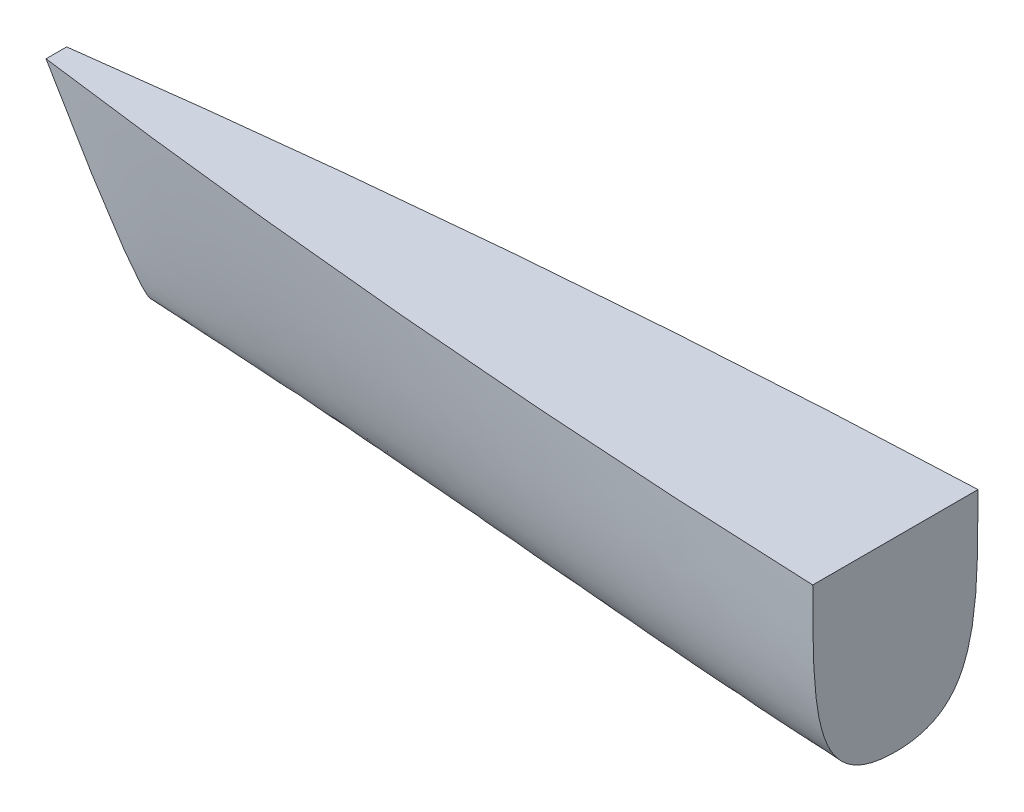
ISO-10303-21;
HEADER;
FILE_DESCRIPTION(('STEP AP214'),'2;1');
FILE_NAME('part.step','',(''),(''),'','','');
FILE_SCHEMA(('AUTOMOTIVE_DESIGN { 1 0 10303 214 1 1 1 1 }'));
ENDSEC;
DATA;
#1=APPLICATION_CONTEXT('core data for automotive mechanical design processes');
#2=APPLICATION_PROTOCOL_DEFINITION('international standard','automotive_design',2000,#1);
#3=PRODUCT_CONTEXT('',#1,'mechanical');
#4=PRODUCT('Part','Part','',(#3));
#5=PRODUCT_RELATED_PRODUCT_CATEGORY('part','',(#4));
#6=PRODUCT_DEFINITION_FORMATION('','',#4);
#7=PRODUCT_DEFINITION_CONTEXT('part definition',#1,'design');
#8=PRODUCT_DEFINITION('design','',#6,#7);
#9=PRODUCT_DEFINITION_SHAPE('','',#8);
#10=(LENGTH_UNIT() NAMED_UNIT(*) SI_UNIT(.MILLI.,.METRE.));
#11=(NAMED_UNIT(*) PLANE_ANGLE_UNIT() SI_UNIT($,.RADIAN.));
#12=(NAMED_UNIT(*) SI_UNIT($,.STERADIAN.) SOLID_ANGLE_UNIT());
#13=UNCERTAINTY_MEASURE_WITH_UNIT(LENGTH_MEASURE(1.E-05),#10,'distance_accuracy_value','');
#14=(GEOMETRIC_REPRESENTATION_CONTEXT(3) GLOBAL_UNCERTAINTY_ASSIGNED_CONTEXT((#13)) GLOBAL_UNIT_ASSIGNED_CONTEXT((#10,
#11,#12)) REPRESENTATION_CONTEXT('',''));
#15=CARTESIAN_POINT('',(0.,0.,0.));
#16=DIRECTION('',(0.,0.,1.));
#17=DIRECTION('',(1.,0.,0.));
#18=AXIS2_PLACEMENT_3D('',#15,#16,#17);
#19=CARTESIAN_POINT('',(0.,0.,0.));
#20=DIRECTION('',(1.,0.,0.));
#21=DIRECTION('',(0.,0.,-1.));
#22=AXIS2_PLACEMENT_3D('',#19,#20,#21);
#23=PLANE('',#22);
#24=DIRECTION('',(0.,0.,-1.));
#25=VECTOR('',#24,1.);
#26=CARTESIAN_POINT('',(0.,101.6,44.45));
#27=LINE('',#26,#25);
#28=CARTESIAN_POINT('',(9.40191802610385E-11,101.6,50.8000000000035));
#29=VERTEX_POINT('',#28);
#30=CARTESIAN_POINT('',(9.40191802610385E-11,101.6,-50.8000000000035));
#31=VERTEX_POINT('',#30);
#32=EDGE_CURVE('E79',#29,#31,#27,.T.);
#33=ORIENTED_EDGE('',*,*,#32,.F.);
#34=CARTESIAN_POINT('',(-4.47736069341578E-09,-12.7000000000048,0.));
#35=CARTESIAN_POINT('',(-4.45366732851943E-09,-12.6999707094019,0.781487751641772));
#36=CARTESIAN_POINT('',(-4.42971820009839E-09,-12.6889781682521,1.5630419349123));
#37=CARTESIAN_POINT('',(-4.38192011345438E-09,-12.6437010870272,3.10169913771779));
#38=CARTESIAN_POINT('',(-4.3580902153228E-09,-12.6101342953921,3.85882366023383));
#39=CARTESIAN_POINT('',(-4.31043945637957E-09,-12.5199320026486,5.34902751975938));
#40=CARTESIAN_POINT('',(-4.28663958618666E-09,-12.4640154972523,6.08214958026038));
#41=CARTESIAN_POINT('',(-4.23918911087635E-09,-12.3292978902542,7.52470274285807));
#42=CARTESIAN_POINT('',(-4.21555446043169E-09,-12.2512131273073,8.2342002157884));
#43=CARTESIAN_POINT('',(-4.16826270267955E-09,-12.0723599111245,9.62987044012015));
#44=CARTESIAN_POINT('',(-4.14462530548699E-09,-11.9722988449897,10.3161332422138));
#45=CARTESIAN_POINT('',(-4.09752950081662E-09,-11.7496973949316,11.6656967473971));
#46=CARTESIAN_POINT('',(-4.07408396605494E-09,-11.6278488428377,12.3291109860748));
#47=CARTESIAN_POINT('',(-4.02712035639675E-09,-11.3618845844641,13.6333412633285));
#48=CARTESIAN_POINT('',(-4.00362036377617E-09,-11.218437850424,14.2742931580272));
#49=CARTESIAN_POINT('',(-3.95680463212218E-09,-10.9094968294993,15.5339637655974));
#50=CARTESIAN_POINT('',(-3.93349889224186E-09,-10.744640963376,16.1528385225982));
#51=CARTESIAN_POINT('',(-3.88686751606332E-09,-10.3931093121053,17.3687223145348));
#52=CARTESIAN_POINT('',(-3.8635550752632E-09,-10.2070335469576,17.9659043364015));
#53=CARTESIAN_POINT('',(-3.81699681902432E-09,-9.81329776601531,19.1387736399576));
#54=CARTESIAN_POINT('',(-3.79376047029151E-09,-9.60619170353381,19.7146464528796));
#55=CARTESIAN_POINT('',(-3.74734862029848E-09,-9.170638743577,20.8452730457951));
#56=CARTESIAN_POINT('',(-3.72418093818784E-09,-8.94269263807592,21.400219380165));
#57=CARTESIAN_POINT('',(-3.67784564586512E-09,-8.46571002893252,22.4893745727515));
#58=CARTESIAN_POINT('',(-3.65468520317717E-09,-8.21711505234996,23.0237764990578));
#59=CARTESIAN_POINT('',(-3.60848595195766E-09,-7.69909099889839,24.0722312469046));
#60=CARTESIAN_POINT('',(-3.5854507165306E-09,-7.43003948152166,24.5864703962378));
#61=CARTESIAN_POINT('',(-3.53937030355996E-09,-6.87136292875235,25.5949954602892));
#62=CARTESIAN_POINT('',(-3.51632909795275E-09,-6.58204853747093,26.0894533119272));
#63=CARTESIAN_POINT('',(-3.4703152038318E-09,-5.98310918714257,27.0588194509133));
#64=CARTESIAN_POINT('',(-3.44734429899788E-09,-5.67372701426701,27.5338776660173));
#65=CARTESIAN_POINT('',(-3.40141615486548E-09,-5.0349152857695,28.4648558464261));
#66=CARTESIAN_POINT('',(-3.37846021910957E-09,-4.70566182886777,28.9208966140225));
#67=CARTESIAN_POINT('',(-3.33260349131233E-09,-4.02736876232375,29.8142582167664));
#68=CARTESIAN_POINT('',(-3.30970303997775E-09,-3.6784417905124,30.2516645733004));
#69=CARTESIAN_POINT('',(-3.26392667012989E-09,-2.96105889858107,31.1081815755418));
#70=CARTESIAN_POINT('',(-3.24105084758921E-09,-2.59265721718293,31.5273376606002));
#71=CARTESIAN_POINT('',(-3.19532383563999E-09,-1.83657629941983,32.347782773729));
#72=CARTESIAN_POINT('',(-3.1724726435475E-09,-1.44889943992592,32.7490739932511));
#73=CARTESIAN_POINT('',(-3.12679273175931E-09,-0.654512378917812,33.5342207439993));
#74=CARTESIAN_POINT('',(-3.10396418611828E-09,-0.247760251175753,33.9180338262512));
#75=CARTESIAN_POINT('',(-3.05837700848049E-09,0.584541188637023,34.6686565761279));
#76=CARTESIAN_POINT('',(-3.03561918638764E-09,1.01016864260761,35.0353795219674));
#77=CARTESIAN_POINT('',(-2.99002738659927E-09,1.87999299346549,35.7522534280396));
#78=CARTESIAN_POINT('',(-2.96719393657309E-09,2.32429610799612,36.1022753707059));
#79=CARTESIAN_POINT('',(-2.9216009365089E-09,3.23125234239316,36.786176299614));
#80=CARTESIAN_POINT('',(-2.89884377989147E-09,3.69403197678958,37.1198873018264));
#81=CARTESIAN_POINT('',(-2.85332036073557E-09,4.63772959919391,37.7715917059864));
#82=CARTESIAN_POINT('',(-2.83055652736659E-09,5.11878730134776,38.0893825161859));
#83=CARTESIAN_POINT('',(-2.78504286890497E-09,6.09883641928646,38.7096673099536));
#84=CARTESIAN_POINT('',(-2.76229655939743E-09,6.59797454833304,39.0119291360415));
#85=CARTESIAN_POINT('',(-2.71681655609945E-09,7.61398580238174,39.6015715043192));
#86=CARTESIAN_POINT('',(-2.69408718760793E-09,8.13100744610802,39.8886957138591));
#87=CARTESIAN_POINT('',(-2.64857754172488E-09,9.18259227931243,40.4484731777496));
#88=CARTESIAN_POINT('',(-2.62580143538289E-09,9.71730163586938,40.7208513741957));
#89=CARTESIAN_POINT('',(-2.58030868260116E-09,10.8040711118557,41.251540930432));
#90=CARTESIAN_POINT('',(-2.55759860238851E-09,11.3562718509201,41.5095637587779));
#91=CARTESIAN_POINT('',(-2.51207750930681E-09,12.4778408976706,42.0119446409976));
#92=CARTESIAN_POINT('',(-2.48927105294809E-09,13.047342068145,42.2560056446732));
#93=CARTESIAN_POINT('',(-2.44375872687278E-09,14.203312921084,42.73084834855));
#94=CARTESIAN_POINT('',(-2.42106136439048E-09,14.7899058910274,42.9613287054393));
#95=CARTESIAN_POINT('',(-2.35221451287566E-09,16.5909650041421,43.6395235377354));
#96=CARTESIAN_POINT('',(-2.30655657830168E-09,17.8156729065473,44.0602109546952));
#97=CARTESIAN_POINT('',(-2.21526940078216E-09,20.3301926861742,44.8542729737344));
#98=CARTESIAN_POINT('',(-2.16970426593822E-09,21.620732712122,45.2253086462873));
#99=CARTESIAN_POINT('',(-2.07833635816551E-09,24.2656666833734,45.9231115357718));
#100=CARTESIAN_POINT('',(-2.03258926863268E-09,25.6206349326412,46.2476851700081));
#101=CARTESIAN_POINT('',(-1.94091122802775E-09,28.3930082657146,46.8554982033305));
#102=CARTESIAN_POINT('',(-1.89503776327385E-09,29.8108487118198,47.1367301403007));
#103=CARTESIAN_POINT('',(-1.8031068105125E-09,32.707567119788,47.6607732784165));
#104=CARTESIAN_POINT('',(-1.75710495937111E-09,34.186767289243,47.9017844629283));
#105=CARTESIAN_POINT('',(-1.66493108656309E-09,37.2047678238614,48.3482816640007));
#106=CARTESIAN_POINT('',(-1.61881232092425E-09,38.7438002745625,48.5521804027371));
#107=CARTESIAN_POINT('',(-1.52627915434583E-09,41.8800068374668,48.9273432886412));
#108=CARTESIAN_POINT('',(-1.47991011428412E-09,43.4773438521192,49.0972280818237));
#109=CARTESIAN_POINT('',(-1.38694311716917E-09,46.7286805702724,49.4072770566732));
#110=CARTESIAN_POINT('',(-1.34038920936828E-09,48.3827914468087,49.5462595166903));
#111=CARTESIAN_POINT('',(-1.24701070833235E-09,51.7461740770097,49.7973630062423));
#112=CARTESIAN_POINT('',(-1.20022501944852E-09,53.4555191318386,49.9084835375982));
#113=CARTESIAN_POINT('',(-1.05735405333697E-09,58.7411843474163,50.2106641212133));
#114=CARTESIAN_POINT('',(-9.63162646276416E-10,62.3200696784898,50.3566993833725));
#115=CARTESIAN_POINT('',(-8.22758162324925E-10,67.7654104503835,50.5216473998408));
#116=CARTESIAN_POINT('',(-7.7516905878392E-10,69.6312114045692,50.5679471037314));
#117=CARTESIAN_POINT('',(-6.7969903275123E-10,73.4119103561285,50.6454793729367));
#118=CARTESIAN_POINT('',(-6.3184296751189E-10,75.3268175596709,50.6762867032826));
#119=CARTESIAN_POINT('',(-5.35763610913864E-10,79.2041484885118,50.7258817368804));
#120=CARTESIAN_POINT('',(-4.87560521046109E-10,81.1665758257082,50.7443532487314));
#121=CARTESIAN_POINT('',(-3.90864017270271E-10,85.137414800624,50.7722535915417));
#122=CARTESIAN_POINT('',(-3.42390204111398E-10,87.1458279184803,50.7814607082577));
#123=CARTESIAN_POINT('',(-2.45047892762379E-10,91.2070889082284,50.793870336641));
#124=CARTESIAN_POINT('',(-1.96194377295594E-10,93.2599370936573,50.7969355390775));
#125=CARTESIAN_POINT('',(-9.81199514417062E-11,97.4085249587485,50.7999955091068));
#126=CARTESIAN_POINT('',(-4.89126889609797E-11,99.5042647053791,50.7999247910011));
#127=CARTESIAN_POINT('',(0.,101.6,50.8));
#128=B_SPLINE_CURVE_WITH_KNOTS('',3,(#34,#35,#36,#37,#38,#39,#40,#41,#42,#43,#44,#45,#46,#47,
#48,#49,#50,#51,#52,#53,#54,#55,#56,#57,#58,#59,#60,#61,#62,#63,#64,#65,#66,#67,#68,#69,#70,#71,
#72,#73,#74,#75,#76,#77,#78,#79,#80,#81,#82,#83,#84,#85,#86,#87,#88,#89,#90,#91,#92,#93,#94,#95,
#96,#97,#98,#99,#100,#101,#102,#103,#104,#105,#106,#107,#108,#109,#110,#111,#112,#113,#114,#115,
#116,#117,#118,#119,#120,#121,#122,#123,#124,#125,#126,#127),.UNSPECIFIED.,.F.,.F.,(4,2,2,2,2,2,
2,2,2,2,2,2,2,2,2,2,2,2,2,2,2,2,2,2,2,2,2,2,2,2,2,2,2,2,2,2,2,2,2,2,2,2,2,2,2,2,4),(0.,
2.34448344306046,4.61774226111642,6.82310024341743,8.96402535855335,11.0441331812292,
13.0671882793458,15.0371030237134,16.9579332678533,18.8338703702723,20.6692291084447,
22.4684311716548,24.2359841218744,25.976455971705,27.6944458284447,29.3945513644529,
31.0813341586681,32.7592841724686,34.4327847407006,36.1060794546907,37.7832421862112,
39.4681512670997,41.164468531767,42.87562359078,44.6048033744678,46.3549466998827,
48.1287433942653,49.9286373621692,51.7568329090987,53.61530362153,55.5058031370405,
59.3885196148072,63.4155115389168,67.5941712327691,71.9295940697895,76.4249473575493,
81.0817950020447,85.9003767053856,90.8798446583309,96.0184625913589,106.762495300085,
112.361605648281,118.106994580152,123.994511562909,130.019797185493,136.178345565122,
142.465558891021),.UNSPECIFIED.);
#129=CARTESIAN_POINT('',(0.,-12.6999999999999,0.));
#130=VERTEX_POINT('',#129);
#131=EDGE_CURVE('E81',#130,#29,#128,.T.);
#132=ORIENTED_EDGE('',*,*,#131,.F.);
#133=CARTESIAN_POINT('',(9.40219175513375E-11,101.6,-50.8000000000035));
#134=CARTESIAN_POINT('',(9.03848008340078E-11,33.8666666666628,-50.800000000004));
#135=CARTESIAN_POINT('',(8.79168231380156E-11,-12.6999999999998,-50.8000000000073));
#136=CARTESIAN_POINT('',(8.88058790979759E-11,-12.6999999999998,0.));
#137=B_SPLINE_CURVE_WITH_KNOTS('',3,(#133,#134,#135,#136),.UNSPECIFIED.,.F.,.F.,(4,4),(0.,1.),.UNSPECIFIED.);
#138=EDGE_CURVE('E82',#31,#130,#137,.T.);
#139=ORIENTED_EDGE('',*,*,#138,.F.);
#140=EDGE_LOOP('',(#33,#132,#139));
#141=FACE_BOUND('',#140,.T.);
#142=ADVANCED_FACE('F35',(#141),#23,.T.);
#143=CARTESIAN_POINT('',(-473.829393674833,28.8029547438754,4.7625));
#144=DIRECTION('',(-0.866025403784437,-0.500000000000003,0.));
#145=DIRECTION('',(0.500000000000003,-0.866025403784437,0.));
#146=AXIS2_PLACEMENT_3D('',#143,#144,#145);
#147=PLANE('',#146);
#148=CARTESIAN_POINT('',(-515.858787349667,101.6,6.35));
#149=CARTESIAN_POINT('',(-481.992120683,42.9412126503344,6.35));
#150=CARTESIAN_POINT('',(-457.2,0.,4.23333333333333));
#151=CARTESIAN_POINT('',(-457.2,0.,0.));
#152=B_SPLINE_CURVE_WITH_KNOTS('',3,(#148,#149,#150,#151),.UNSPECIFIED.,.F.,.F.,(4,4),(0.,1.),.UNSPECIFIED.);
#153=CARTESIAN_POINT('',(-515.858787349667,101.6,6.35));
#154=VERTEX_POINT('',#153);
#155=CARTESIAN_POINT('',(-457.2,0.,0.));
#156=VERTEX_POINT('',#155);
#157=EDGE_CURVE('E97',#154,#156,#152,.T.);
#158=ORIENTED_EDGE('',*,*,#157,.F.);
#159=DIRECTION('',(0.,0.,1.));
#160=VECTOR('',#159,1.);
#161=CARTESIAN_POINT('',(-515.858787349667,101.6,6.35));
#162=LINE('',#161,#160);
#163=CARTESIAN_POINT('',(-515.858787349667,101.6,0.));
#164=VERTEX_POINT('',#163);
#165=EDGE_CURVE('E93',#164,#154,#162,.T.);
#166=ORIENTED_EDGE('',*,*,#165,.F.);
#167=DIRECTION('',(0.,0.,-1.));
#168=VECTOR('',#167,1.);
#169=CARTESIAN_POINT('',(-515.858787349667,101.6,-6.35));
#170=LINE('',#169,#168);
#171=CARTESIAN_POINT('',(-515.858787349667,101.6,-6.35));
#172=VERTEX_POINT('',#171);
#173=EDGE_CURVE('E48',#164,#172,#170,.T.);
#174=ORIENTED_EDGE('',*,*,#173,.T.);
#175=CARTESIAN_POINT('',(-515.858787349667,101.6,-6.35));
#176=CARTESIAN_POINT('',(-481.992120683,42.9412126503344,-6.35));
#177=CARTESIAN_POINT('',(-457.2,0.,-4.23333333333333));
#178=CARTESIAN_POINT('',(-457.2,0.,0.));
#179=B_SPLINE_CURVE_WITH_KNOTS('',3,(#175,#176,#177,#178),.UNSPECIFIED.,.F.,.F.,(4,4),(0.,1.),.UNSPECIFIED.);
#180=EDGE_CURVE('E11',#172,#156,#179,.T.);
#181=ORIENTED_EDGE('',*,*,#180,.T.);
#182=EDGE_LOOP('',(#158,#166,#174,#181));
#183=FACE_BOUND('',#182,.T.);
#184=ADVANCED_FACE('F169',(#183),#147,.T.);
#185=CARTESIAN_POINT('',(457.2,0.,0.));
#186=CARTESIAN_POINT('',(304.8,-8.4666666666666,0.));
#187=CARTESIAN_POINT('',(-24.1558528702352,-16.9466068796095,0.));
#188=CARTESIAN_POINT('',(-304.8,-8.4666666666666,0.));
#189=CARTESIAN_POINT('',(-457.2,0.,0.));
#190=CARTESIAN_POINT('',(457.2,0.,59.2666666666667));
#191=CARTESIAN_POINT('',(304.694653848716,-5.6444444444444,62.6627208631764));
#192=CARTESIAN_POINT('',(-27.0609494606047,-19.7776781326826,62.3667373112781));
#193=CARTESIAN_POINT('',(-298.387703112432,-5.6444444444444,11.8627208631764));
#194=CARTESIAN_POINT('',(-457.2,0.,4.23333333333333));
#195=CARTESIAN_POINT('',(457.2,16.9333333333334,44.45));
#196=CARTESIAN_POINT('',(304.589307697432,14.1111111111112,51.2421083930194));
#197=CARTESIAN_POINT('',(-18.5135242684559,41.6700336822248,64.0453866142405));
#198=CARTESIAN_POINT('',(-316.767526907864,40.1189904281121,21.6087750596861));
#199=CARTESIAN_POINT('',(-481.992120683,42.9412126503344,6.35));
#200=CARTESIAN_POINT('',(457.2,101.6,44.45));
#201=CARTESIAN_POINT('',(304.483961546148,101.6,54.6381625895292));
#202=CARTESIAN_POINT('',(-5.77418516651111,101.6,58.6831296847267));
#203=CARTESIAN_POINT('',(-344.221896686963,101.6,29.2381625895292));
#204=CARTESIAN_POINT('',(-515.858787349667,101.6,6.35));
#205=B_SPLINE_SURFACE_WITH_KNOTS('',3,3,((#185,#186,#187,#188,#189),(#190,#191,#192,#193,#194),
(#195,#196,#197,#198,#199),(#200,#201,#202,#203,#204)),.UNSPECIFIED.,.F.,.F.,.F.,(4,4),(4,1,4),
(0.,1.),(0.,0.48021814139568,1.),.UNSPECIFIED.);
#206=CARTESIAN_POINT('',(457.2,0.,0.));
#207=CARTESIAN_POINT('',(304.8,-8.46666666666659,0.));
#208=CARTESIAN_POINT('',(-24.1558528702352,-16.9466068796095,0.));
#209=CARTESIAN_POINT('',(-304.8,-8.46666666666659,0.));
#210=CARTESIAN_POINT('',(-457.2,0.,0.));
#211=B_SPLINE_CURVE_WITH_KNOTS('',3,(#206,#207,#208,#209,#210),.UNSPECIFIED.,.F.,.F.,(4,1,4),
(0.,0.48021814139568,1.),.UNSPECIFIED.);
#212=EDGE_CURVE('E64',#130,#156,#211,.T.);
#213=CARTESIAN_POINT('',(457.2,101.6,44.45));
#214=CARTESIAN_POINT('',(304.483961546148,101.6,54.6381625895292));
#215=CARTESIAN_POINT('',(-5.77418516651111,101.6,58.6831296847267));
#216=CARTESIAN_POINT('',(-344.221896686963,101.6,29.2381625895292));
#217=CARTESIAN_POINT('',(-515.858787349667,101.6,6.35));
#218=B_SPLINE_CURVE_WITH_KNOTS('',3,(#213,#214,#215,#216,#217),.UNSPECIFIED.,.F.,.F.,(4,1,4),
(0.,0.48021814139568,1.),.UNSPECIFIED.);
#219=EDGE_CURVE('E88',#154,#29,#218,.F.);
#220=ORIENTED_EDGE('',*,*,#212,.F.);
#221=ORIENTED_EDGE('',*,*,#131,.T.);
#222=ORIENTED_EDGE('',*,*,#219,.F.);
#223=ORIENTED_EDGE('',*,*,#157,.T.);
#224=EDGE_LOOP('',(#220,#221,#222,#223));
#225=FACE_BOUND('',#224,.T.);
#226=ADVANCED_FACE('F86',(#225),#205,.T.);
#227=CARTESIAN_POINT('',(457.2,101.6,44.45));
#228=DIRECTION('',(0.,1.,0.));
#229=DIRECTION('',(0.,0.,-1.));
#230=AXIS2_PLACEMENT_3D('',#227,#228,#229);
#231=PLANE('',#230);
#232=ORIENTED_EDGE('',*,*,#219,.T.);
#233=ORIENTED_EDGE('',*,*,#32,.T.);
#234=CARTESIAN_POINT('',(457.2,101.6,-44.45));
#235=CARTESIAN_POINT('',(304.483961546148,101.6,-54.6381625895292));
#236=CARTESIAN_POINT('',(-5.77418516651111,101.6,-58.6831296847267));
#237=CARTESIAN_POINT('',(-344.221896686963,101.6,-29.2381625895292));
#238=CARTESIAN_POINT('',(-515.858787349667,101.6,-6.35));
#239=B_SPLINE_CURVE_WITH_KNOTS('',3,(#234,#235,#236,#237,#238),.UNSPECIFIED.,.F.,.F.,(4,1,4),
(0.,0.48021814139568,1.),.UNSPECIFIED.);
#240=EDGE_CURVE('E56',#172,#31,#239,.F.);
#241=ORIENTED_EDGE('',*,*,#240,.F.);
#242=ORIENTED_EDGE('',*,*,#173,.F.);
#243=ORIENTED_EDGE('',*,*,#165,.T.);
#244=EDGE_LOOP('',(#232,#233,#241,#242,#243));
#245=FACE_BOUND('',#244,.T.);
#246=ADVANCED_FACE('F91',(#245),#231,.T.);
#247=CARTESIAN_POINT('',(457.2,0.,0.));
#248=CARTESIAN_POINT('',(304.8,-8.4666666666666,0.));
#249=CARTESIAN_POINT('',(-24.1558528702352,-16.9466068796095,0.));
#250=CARTESIAN_POINT('',(-304.8,-8.4666666666666,0.));
#251=CARTESIAN_POINT('',(-457.2,0.,0.));
#252=CARTESIAN_POINT('',(457.2,0.,-59.2666666666667));
#253=CARTESIAN_POINT('',(304.694653848716,-5.6444444444444,-62.6627208631764));
#254=CARTESIAN_POINT('',(-27.0609494606047,-19.7776781326826,-62.3667373112781));
#255=CARTESIAN_POINT('',(-298.387703112432,-5.6444444444444,-11.8627208631764));
#256=CARTESIAN_POINT('',(-457.2,0.,-4.23333333333333));
#257=CARTESIAN_POINT('',(457.2,16.9333333333334,-44.45));
#258=CARTESIAN_POINT('',(304.589307697432,14.1111111111112,-51.2421083930194));
#259=CARTESIAN_POINT('',(-18.5135242684559,41.6700336822248,-64.0453866142405));
#260=CARTESIAN_POINT('',(-316.767526907864,40.1189904281121,-21.6087750596861));
#261=CARTESIAN_POINT('',(-481.992120683,42.9412126503344,-6.35));
#262=CARTESIAN_POINT('',(457.2,101.6,-44.45));
#263=CARTESIAN_POINT('',(304.483961546148,101.6,-54.6381625895292));
#264=CARTESIAN_POINT('',(-5.77418516651111,101.6,-58.6831296847267));
#265=CARTESIAN_POINT('',(-344.221896686963,101.6,-29.2381625895292));
#266=CARTESIAN_POINT('',(-515.858787349667,101.6,-6.35));
#267=B_SPLINE_SURFACE_WITH_KNOTS('',3,3,((#247,#248,#249,#250,#251),(#252,#253,#254,#255,#256),
(#257,#258,#259,#260,#261),(#262,#263,#264,#265,#266)),.UNSPECIFIED.,.F.,.F.,.F.,(4,4),(4,1,4),
(0.,1.),(0.,0.48021814139568,1.),.UNSPECIFIED.);
#268=ORIENTED_EDGE('',*,*,#240,.T.);
#269=ORIENTED_EDGE('',*,*,#138,.T.);
#270=ORIENTED_EDGE('',*,*,#212,.T.);
#271=ORIENTED_EDGE('',*,*,#180,.F.);
#272=EDGE_LOOP('',(#268,#269,#270,#271));
#273=FACE_BOUND('',#272,.T.);
#274=ADVANCED_FACE('F133',(#273),#267,.F.);
#275=CLOSED_SHELL('',(#142,#184,#226,#246,#274));
#276=MANIFOLD_SOLID_BREP('B2',#275);
#277=ADVANCED_BREP_SHAPE_REPRESENTATION('',(#18,#276),#14);
#278=SHAPE_DEFINITION_REPRESENTATION(#9,#277);
ENDSEC;
END-ISO-10303-21;
